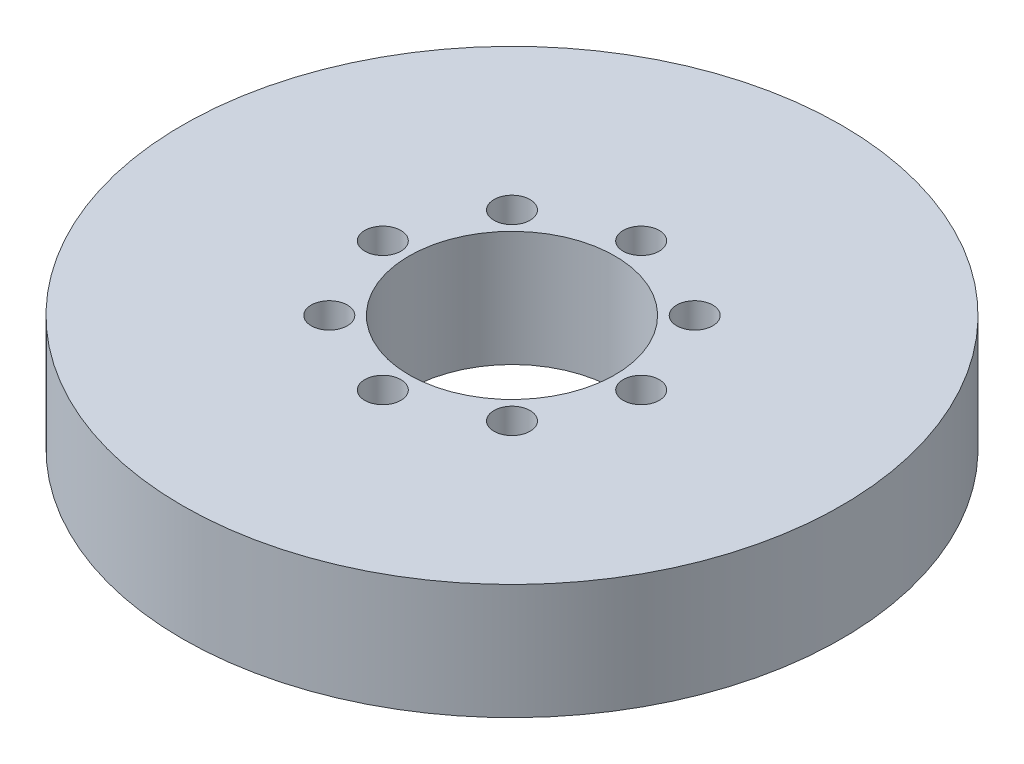
ISO-10303-21;
HEADER;
FILE_DESCRIPTION(('STEP AP214'),'2;1');
FILE_NAME('part.step','',(''),(''),'','','');
FILE_SCHEMA(('AUTOMOTIVE_DESIGN { 1 0 10303 214 1 1 1 1 }'));
ENDSEC;
DATA;
#1=APPLICATION_CONTEXT('core data for automotive mechanical design processes');
#2=APPLICATION_PROTOCOL_DEFINITION('international standard','automotive_design',2000,#1);
#3=PRODUCT_CONTEXT('',#1,'mechanical');
#4=PRODUCT('Part','Part','',(#3));
#5=PRODUCT_RELATED_PRODUCT_CATEGORY('part','',(#4));
#6=PRODUCT_DEFINITION_FORMATION('','',#4);
#7=PRODUCT_DEFINITION_CONTEXT('part definition',#1,'design');
#8=PRODUCT_DEFINITION('design','',#6,#7);
#9=PRODUCT_DEFINITION_SHAPE('','',#8);
#10=(LENGTH_UNIT() NAMED_UNIT(*) SI_UNIT(.MILLI.,.METRE.));
#11=(NAMED_UNIT(*) PLANE_ANGLE_UNIT() SI_UNIT($,.RADIAN.));
#12=(NAMED_UNIT(*) SI_UNIT($,.STERADIAN.) SOLID_ANGLE_UNIT());
#13=UNCERTAINTY_MEASURE_WITH_UNIT(LENGTH_MEASURE(1.E-05),#10,'distance_accuracy_value','');
#14=(GEOMETRIC_REPRESENTATION_CONTEXT(3) GLOBAL_UNCERTAINTY_ASSIGNED_CONTEXT((#13)) GLOBAL_UNIT_ASSIGNED_CONTEXT((#10,
#11,#12)) REPRESENTATION_CONTEXT('',''));
#15=CARTESIAN_POINT('',(0.,0.,0.));
#16=DIRECTION('',(0.,0.,1.));
#17=DIRECTION('',(1.,0.,0.));
#18=AXIS2_PLACEMENT_3D('',#15,#16,#17);
#19=CARTESIAN_POINT('',(0.,14.,0.));
#20=DIRECTION('',(0.,-1.,0.));
#21=DIRECTION('',(0.,0.,-1.));
#22=AXIS2_PLACEMENT_3D('',#19,#20,#21);
#23=CYLINDRICAL_SURFACE('',#22,40.);
#24=CARTESIAN_POINT('',(0.,14.,0.));
#25=DIRECTION('',(0.,1.,0.));
#26=DIRECTION('',(0.,0.,1.));
#27=AXIS2_PLACEMENT_3D('',#24,#25,#26);
#28=CIRCLE('',#27,40.);
#29=CARTESIAN_POINT('',(0.,14.,40.));
#30=VERTEX_POINT('',#29);
#31=EDGE_CURVE('E10',#30,#30,#28,.T.);
#32=ORIENTED_EDGE('',*,*,#31,.F.);
#33=EDGE_LOOP('',(#32));
#34=FACE_BOUND('',#33,.T.);
#35=CARTESIAN_POINT('',(0.,0.,0.));
#36=DIRECTION('',(0.,1.,0.));
#37=DIRECTION('',(0.,0.,1.));
#38=AXIS2_PLACEMENT_3D('',#35,#36,#37);
#39=CIRCLE('',#38,40.);
#40=CARTESIAN_POINT('',(0.,0.,40.));
#41=VERTEX_POINT('',#40);
#42=EDGE_CURVE('E37',#41,#41,#39,.T.);
#43=ORIENTED_EDGE('',*,*,#42,.T.);
#44=EDGE_LOOP('',(#43));
#45=FACE_BOUND('',#44,.T.);
#46=ADVANCED_FACE('F40',(#34,#45),#23,.T.);
#47=CARTESIAN_POINT('',(0.,14.,0.));
#48=DIRECTION('',(0.,1.,0.));
#49=DIRECTION('',(0.,0.,1.));
#50=AXIS2_PLACEMENT_3D('',#47,#48,#49);
#51=PLANE('',#50);
#52=CARTESIAN_POINT('',(0.,14.,15.6810859450207));
#53=DIRECTION('',(0.,1.,0.));
#54=DIRECTION('',(1.,0.,0.));
#55=AXIS2_PLACEMENT_3D('',#52,#53,#54);
#56=CIRCLE('',#55,2.19036456393858);
#57=CARTESIAN_POINT('',(2.19036456393864,14.,15.6810859450207));
#58=VERTEX_POINT('',#57);
#59=EDGE_CURVE('E88',#58,#58,#56,.T.);
#60=ORIENTED_EDGE('',*,*,#59,.F.);
#61=EDGE_LOOP('',(#60));
#62=FACE_BOUND('',#61,.T.);
#63=CARTESIAN_POINT('',(11.0882022080932,14.,11.0882022080931));
#64=DIRECTION('',(0.,1.,0.));
#65=DIRECTION('',(0.707106781186544,0.,-0.707106781186551));
#66=AXIS2_PLACEMENT_3D('',#63,#64,#65);
#67=CIRCLE('',#66,2.19036456393858);
#68=CARTESIAN_POINT('',(12.6370238445249,14.,9.53938057166142));
#69=VERTEX_POINT('',#68);
#70=EDGE_CURVE('E79',#69,#69,#67,.T.);
#71=ORIENTED_EDGE('',*,*,#70,.F.);
#72=EDGE_LOOP('',(#71));
#73=FACE_BOUND('',#72,.T.);
#74=CARTESIAN_POINT('',(15.6810859450207,14.,0.));
#75=DIRECTION('',(0.,1.,0.));
#76=DIRECTION('',(0.,0.,-1.));
#77=AXIS2_PLACEMENT_3D('',#74,#75,#76);
#78=CIRCLE('',#77,2.19036456393858);
#79=CARTESIAN_POINT('',(15.6810859450207,14.,-2.19036456393858));
#80=VERTEX_POINT('',#79);
#81=EDGE_CURVE('E74',#80,#80,#78,.T.);
#82=ORIENTED_EDGE('',*,*,#81,.F.);
#83=EDGE_LOOP('',(#82));
#84=FACE_BOUND('',#83,.T.);
#85=CARTESIAN_POINT('',(11.0882022080931,14.,-11.0882022080933));
#86=DIRECTION('',(0.,1.,0.));
#87=DIRECTION('',(-0.707106781186554,0.,-0.707106781186541));
#88=AXIS2_PLACEMENT_3D('',#85,#86,#87);
#89=CIRCLE('',#88,2.19036456393858);
#90=CARTESIAN_POINT('',(9.53938057166138,14.,-12.6370238445249));
#91=VERTEX_POINT('',#90);
#92=EDGE_CURVE('E70',#91,#91,#89,.T.);
#93=ORIENTED_EDGE('',*,*,#92,.F.);
#94=EDGE_LOOP('',(#93));
#95=FACE_BOUND('',#94,.T.);
#96=CARTESIAN_POINT('',(-1.64250656849505E-13,14.,-15.6810859450207));
#97=DIRECTION('',(0.,1.,0.));
#98=DIRECTION('',(-1.,0.,0.));
#99=AXIS2_PLACEMENT_3D('',#96,#97,#98);
#100=CIRCLE('',#99,2.19036456393858);
#101=CARTESIAN_POINT('',(-2.19036456393875,14.,-15.6810859450206));
#102=VERTEX_POINT('',#101);
#103=EDGE_CURVE('E100',#102,#102,#100,.T.);
#104=ORIENTED_EDGE('',*,*,#103,.F.);
#105=EDGE_LOOP('',(#104));
#106=FACE_BOUND('',#105,.T.);
#107=CARTESIAN_POINT('',(-11.0882022080933,14.,-11.088202208093));
#108=DIRECTION('',(0.,1.,0.));
#109=DIRECTION('',(-0.707106781186539,0.,0.707106781186556));
#110=AXIS2_PLACEMENT_3D('',#107,#108,#109);
#111=CIRCLE('',#110,2.19036456393858);
#112=CARTESIAN_POINT('',(-12.637023844525,14.,-9.53938057166133));
#113=VERTEX_POINT('',#112);
#114=EDGE_CURVE('E93',#113,#113,#111,.T.);
#115=ORIENTED_EDGE('',*,*,#114,.F.);
#116=EDGE_LOOP('',(#115));
#117=FACE_BOUND('',#116,.T.);
#118=CARTESIAN_POINT('',(-11.0882022080932,14.,11.0882022080932));
#119=DIRECTION('',(0.,1.,0.));
#120=DIRECTION('',(0.707106781186549,0.,0.707106781186546));
#121=AXIS2_PLACEMENT_3D('',#118,#119,#120);
#122=CIRCLE('',#121,2.19036456393858);
#123=CARTESIAN_POINT('',(-9.53938057166146,14.,12.6370238445249));
#124=VERTEX_POINT('',#123);
#125=EDGE_CURVE('E61',#124,#124,#122,.T.);
#126=ORIENTED_EDGE('',*,*,#125,.F.);
#127=EDGE_LOOP('',(#126));
#128=FACE_BOUND('',#127,.T.);
#129=CARTESIAN_POINT('',(-15.6810859450207,14.,0.));
#130=DIRECTION('',(0.,1.,0.));
#131=DIRECTION('',(0.,0.,1.));
#132=AXIS2_PLACEMENT_3D('',#129,#130,#131);
#133=CIRCLE('',#132,2.19036456393858);
#134=CARTESIAN_POINT('',(-15.6810859450207,14.,2.19036456393858));
#135=VERTEX_POINT('',#134);
#136=EDGE_CURVE('E54',#135,#135,#133,.T.);
#137=ORIENTED_EDGE('',*,*,#136,.F.);
#138=EDGE_LOOP('',(#137));
#139=FACE_BOUND('',#138,.T.);
#140=CARTESIAN_POINT('',(0.,14.,0.));
#141=DIRECTION('',(0.,1.,0.));
#142=DIRECTION('',(0.,0.,1.));
#143=AXIS2_PLACEMENT_3D('',#140,#141,#142);
#144=CIRCLE('',#143,12.5);
#145=CARTESIAN_POINT('',(0.,14.,12.5));
#146=VERTEX_POINT('',#145);
#147=EDGE_CURVE('E50',#146,#146,#144,.T.);
#148=ORIENTED_EDGE('',*,*,#147,.F.);
#149=EDGE_LOOP('',(#148));
#150=FACE_BOUND('',#149,.T.);
#151=ORIENTED_EDGE('',*,*,#31,.T.);
#152=EDGE_LOOP('',(#151));
#153=FACE_BOUND('',#152,.T.);
#154=ADVANCED_FACE('F115',(#62,#73,#84,#95,#106,#117,#128,#139,#150,#153),#51,.T.);
#155=CARTESIAN_POINT('',(0.,0.,0.));
#156=DIRECTION('',(0.,1.,0.));
#157=DIRECTION('',(0.,0.,1.));
#158=AXIS2_PLACEMENT_3D('',#155,#156,#157);
#159=PLANE('',#158);
#160=CARTESIAN_POINT('',(0.,0.,0.));
#161=DIRECTION('',(0.,1.,0.));
#162=DIRECTION('',(0.,0.,1.));
#163=AXIS2_PLACEMENT_3D('',#160,#161,#162);
#164=CIRCLE('',#163,12.5);
#165=CARTESIAN_POINT('',(0.,0.,12.5));
#166=VERTEX_POINT('',#165);
#167=EDGE_CURVE('E47',#166,#166,#164,.T.);
#168=ORIENTED_EDGE('',*,*,#167,.T.);
#169=EDGE_LOOP('',(#168));
#170=FACE_BOUND('',#169,.T.);
#171=ORIENTED_EDGE('',*,*,#42,.F.);
#172=EDGE_LOOP('',(#171));
#173=FACE_BOUND('',#172,.T.);
#174=ADVANCED_FACE('F113',(#170,#173),#159,.F.);
#175=CARTESIAN_POINT('',(0.,14.,0.));
#176=DIRECTION('',(0.,-1.,0.));
#177=DIRECTION('',(0.,0.,-1.));
#178=AXIS2_PLACEMENT_3D('',#175,#176,#177);
#179=CYLINDRICAL_SURFACE('',#178,12.5);
#180=ORIENTED_EDGE('',*,*,#147,.T.);
#181=EDGE_LOOP('',(#180));
#182=FACE_BOUND('',#181,.T.);
#183=ORIENTED_EDGE('',*,*,#167,.F.);
#184=EDGE_LOOP('',(#183));
#185=FACE_BOUND('',#184,.T.);
#186=ADVANCED_FACE('F127',(#182,#185),#179,.F.);
#187=CARTESIAN_POINT('',(-15.6810859450207,2.38136706259917,0.));
#188=DIRECTION('',(0.,1.,0.));
#189=DIRECTION('',(0.,0.,1.));
#190=AXIS2_PLACEMENT_3D('',#187,#188,#189);
#191=CYLINDRICAL_SURFACE('',#190,2.19036456393858);
#192=CARTESIAN_POINT('',(-15.6810859450207,2.38136706259917,0.));
#193=DIRECTION('',(0.,1.,0.));
#194=DIRECTION('',(0.,0.,1.));
#195=AXIS2_PLACEMENT_3D('',#192,#193,#194);
#196=CIRCLE('',#195,2.19036456393858);
#197=CARTESIAN_POINT('',(-15.6810859450207,2.38136706259917,2.19036456393858));
#198=VERTEX_POINT('',#197);
#199=EDGE_CURVE('E55',#198,#198,#196,.T.);
#200=ORIENTED_EDGE('',*,*,#199,.F.);
#201=EDGE_LOOP('',(#200));
#202=FACE_BOUND('',#201,.T.);
#203=ORIENTED_EDGE('',*,*,#136,.T.);
#204=EDGE_LOOP('',(#203));
#205=FACE_BOUND('',#204,.T.);
#206=ADVANCED_FACE('F129',(#202,#205),#191,.F.);
#207=CARTESIAN_POINT('',(-15.6810859450207,2.38136706259917,0.));
#208=DIRECTION('',(0.,1.,0.));
#209=DIRECTION('',(0.,0.,1.));
#210=AXIS2_PLACEMENT_3D('',#207,#208,#209);
#211=PLANE('',#210);
#212=ORIENTED_EDGE('',*,*,#199,.T.);
#213=EDGE_LOOP('',(#212));
#214=FACE_BOUND('',#213,.T.);
#215=ADVANCED_FACE('F157',(#214),#211,.T.);
#216=CARTESIAN_POINT('',(-11.0882022080932,2.38136706259917,11.0882022080932));
#217=DIRECTION('',(0.,1.,0.));
#218=DIRECTION('',(0.,0.,1.));
#219=AXIS2_PLACEMENT_3D('',#216,#217,#218);
#220=CYLINDRICAL_SURFACE('',#219,2.19036456393858);
#221=CARTESIAN_POINT('',(-11.0882022080932,2.38136706259917,11.0882022080932));
#222=DIRECTION('',(0.,1.,0.));
#223=DIRECTION('',(0.707106781186549,0.,0.707106781186546));
#224=AXIS2_PLACEMENT_3D('',#221,#222,#223);
#225=CIRCLE('',#224,2.19036456393858);
#226=CARTESIAN_POINT('',(-9.53938057166146,2.38136706259917,12.6370238445249));
#227=VERTEX_POINT('',#226);
#228=EDGE_CURVE('E59',#227,#227,#225,.T.);
#229=ORIENTED_EDGE('',*,*,#228,.F.);
#230=EDGE_LOOP('',(#229));
#231=FACE_BOUND('',#230,.T.);
#232=ORIENTED_EDGE('',*,*,#125,.T.);
#233=EDGE_LOOP('',(#232));
#234=FACE_BOUND('',#233,.T.);
#235=ADVANCED_FACE('F170',(#231,#234),#220,.F.);
#236=CARTESIAN_POINT('',(-11.0882022080932,2.38136706259917,11.0882022080932));
#237=DIRECTION('',(0.,1.,0.));
#238=DIRECTION('',(0.707106781186549,0.,0.707106781186546));
#239=AXIS2_PLACEMENT_3D('',#236,#237,#238);
#240=PLANE('',#239);
#241=ORIENTED_EDGE('',*,*,#228,.T.);
#242=EDGE_LOOP('',(#241));
#243=FACE_BOUND('',#242,.T.);
#244=ADVANCED_FACE('F182',(#243),#240,.T.);
#245=CARTESIAN_POINT('',(-11.0882022080933,2.38136706259917,-11.088202208093));
#246=DIRECTION('',(0.,1.,0.));
#247=DIRECTION('',(0.,0.,1.));
#248=AXIS2_PLACEMENT_3D('',#245,#246,#247);
#249=CYLINDRICAL_SURFACE('',#248,2.19036456393858);
#250=CARTESIAN_POINT('',(-11.0882022080933,2.38136706259917,-11.088202208093));
#251=DIRECTION('',(0.,1.,0.));
#252=DIRECTION('',(-0.707106781186539,0.,0.707106781186556));
#253=AXIS2_PLACEMENT_3D('',#250,#251,#252);
#254=CIRCLE('',#253,2.19036456393858);
#255=CARTESIAN_POINT('',(-12.637023844525,2.38136706259917,-9.53938057166133));
#256=VERTEX_POINT('',#255);
#257=EDGE_CURVE('E94',#256,#256,#254,.T.);
#258=ORIENTED_EDGE('',*,*,#257,.F.);
#259=EDGE_LOOP('',(#258));
#260=FACE_BOUND('',#259,.T.);
#261=ORIENTED_EDGE('',*,*,#114,.T.);
#262=EDGE_LOOP('',(#261));
#263=FACE_BOUND('',#262,.T.);
#264=ADVANCED_FACE('F189',(#260,#263),#249,.F.);
#265=CARTESIAN_POINT('',(-11.0882022080933,2.38136706259917,-11.088202208093));
#266=DIRECTION('',(0.,1.,0.));
#267=DIRECTION('',(-0.707106781186539,0.,0.707106781186556));
#268=AXIS2_PLACEMENT_3D('',#265,#266,#267);
#269=PLANE('',#268);
#270=ORIENTED_EDGE('',*,*,#257,.T.);
#271=EDGE_LOOP('',(#270));
#272=FACE_BOUND('',#271,.T.);
#273=ADVANCED_FACE('F107',(#272),#269,.T.);
#274=CARTESIAN_POINT('',(-1.64250656849505E-13,2.38136706259917,-15.6810859450207));
#275=DIRECTION('',(0.,1.,0.));
#276=DIRECTION('',(0.,0.,1.));
#277=AXIS2_PLACEMENT_3D('',#274,#275,#276);
#278=CYLINDRICAL_SURFACE('',#277,2.19036456393858);
#279=CARTESIAN_POINT('',(-1.64250656849505E-13,2.38136706259917,-15.6810859450207));
#280=DIRECTION('',(0.,1.,0.));
#281=DIRECTION('',(-1.,0.,0.));
#282=AXIS2_PLACEMENT_3D('',#279,#280,#281);
#283=CIRCLE('',#282,2.19036456393858);
#284=CARTESIAN_POINT('',(-2.19036456393875,2.38136706259917,-15.6810859450206));
#285=VERTEX_POINT('',#284);
#286=EDGE_CURVE('E72',#285,#285,#283,.T.);
#287=ORIENTED_EDGE('',*,*,#286,.F.);
#288=EDGE_LOOP('',(#287));
#289=FACE_BOUND('',#288,.T.);
#290=ORIENTED_EDGE('',*,*,#103,.T.);
#291=EDGE_LOOP('',(#290));
#292=FACE_BOUND('',#291,.T.);
#293=ADVANCED_FACE('F104',(#289,#292),#278,.F.);
#294=CARTESIAN_POINT('',(-1.64250656849505E-13,2.38136706259917,-15.6810859450207));
#295=DIRECTION('',(0.,1.,0.));
#296=DIRECTION('',(-1.,0.,0.));
#297=AXIS2_PLACEMENT_3D('',#294,#295,#296);
#298=PLANE('',#297);
#299=ORIENTED_EDGE('',*,*,#286,.T.);
#300=EDGE_LOOP('',(#299));
#301=FACE_BOUND('',#300,.T.);
#302=ADVANCED_FACE('F103',(#301),#298,.T.);
#303=CARTESIAN_POINT('',(11.0882022080931,2.38136706259917,-11.0882022080933));
#304=DIRECTION('',(0.,1.,0.));
#305=DIRECTION('',(0.,0.,1.));
#306=AXIS2_PLACEMENT_3D('',#303,#304,#305);
#307=CYLINDRICAL_SURFACE('',#306,2.19036456393858);
#308=CARTESIAN_POINT('',(11.0882022080931,2.38136706259917,-11.0882022080933));
#309=DIRECTION('',(0.,1.,0.));
#310=DIRECTION('',(-0.707106781186554,0.,-0.707106781186541));
#311=AXIS2_PLACEMENT_3D('',#308,#309,#310);
#312=CIRCLE('',#311,2.19036456393858);
#313=CARTESIAN_POINT('',(9.53938057166138,2.38136706259917,-12.6370238445249));
#314=VERTEX_POINT('',#313);
#315=EDGE_CURVE('E69',#314,#314,#312,.T.);
#316=ORIENTED_EDGE('',*,*,#315,.F.);
#317=EDGE_LOOP('',(#316));
#318=FACE_BOUND('',#317,.T.);
#319=ORIENTED_EDGE('',*,*,#92,.T.);
#320=EDGE_LOOP('',(#319));
#321=FACE_BOUND('',#320,.T.);
#322=ADVANCED_FACE('F219',(#318,#321),#307,.F.);
#323=CARTESIAN_POINT('',(11.0882022080931,2.38136706259917,-11.0882022080933));
#324=DIRECTION('',(0.,1.,0.));
#325=DIRECTION('',(-0.707106781186554,0.,-0.707106781186541));
#326=AXIS2_PLACEMENT_3D('',#323,#324,#325);
#327=PLANE('',#326);
#328=ORIENTED_EDGE('',*,*,#315,.T.);
#329=EDGE_LOOP('',(#328));
#330=FACE_BOUND('',#329,.T.);
#331=ADVANCED_FACE('F227',(#330),#327,.T.);
#332=CARTESIAN_POINT('',(15.6810859450207,2.38136706259917,0.));
#333=DIRECTION('',(0.,1.,0.));
#334=DIRECTION('',(0.,0.,1.));
#335=AXIS2_PLACEMENT_3D('',#332,#333,#334);
#336=CYLINDRICAL_SURFACE('',#335,2.19036456393858);
#337=CARTESIAN_POINT('',(15.6810859450207,2.38136706259917,0.));
#338=DIRECTION('',(0.,1.,0.));
#339=DIRECTION('',(0.,0.,-1.));
#340=AXIS2_PLACEMENT_3D('',#337,#338,#339);
#341=CIRCLE('',#340,2.19036456393858);
#342=CARTESIAN_POINT('',(15.6810859450207,2.38136706259917,-2.19036456393858));
#343=VERTEX_POINT('',#342);
#344=EDGE_CURVE('E80',#343,#343,#341,.T.);
#345=ORIENTED_EDGE('',*,*,#344,.F.);
#346=EDGE_LOOP('',(#345));
#347=FACE_BOUND('',#346,.T.);
#348=ORIENTED_EDGE('',*,*,#81,.T.);
#349=EDGE_LOOP('',(#348));
#350=FACE_BOUND('',#349,.T.);
#351=ADVANCED_FACE('F240',(#347,#350),#336,.F.);
#352=CARTESIAN_POINT('',(15.6810859450207,2.38136706259917,0.));
#353=DIRECTION('',(0.,1.,0.));
#354=DIRECTION('',(0.,0.,-1.));
#355=AXIS2_PLACEMENT_3D('',#352,#353,#354);
#356=PLANE('',#355);
#357=ORIENTED_EDGE('',*,*,#344,.T.);
#358=EDGE_LOOP('',(#357));
#359=FACE_BOUND('',#358,.T.);
#360=ADVANCED_FACE('F246',(#359),#356,.T.);
#361=CARTESIAN_POINT('',(11.0882022080932,2.38136706259917,11.0882022080931));
#362=DIRECTION('',(0.,1.,0.));
#363=DIRECTION('',(0.,0.,1.));
#364=AXIS2_PLACEMENT_3D('',#361,#362,#363);
#365=CYLINDRICAL_SURFACE('',#364,2.19036456393858);
#366=CARTESIAN_POINT('',(11.0882022080932,2.38136706259917,11.0882022080931));
#367=DIRECTION('',(0.,1.,0.));
#368=DIRECTION('',(0.707106781186544,0.,-0.707106781186551));
#369=AXIS2_PLACEMENT_3D('',#366,#367,#368);
#370=CIRCLE('',#369,2.19036456393858);
#371=CARTESIAN_POINT('',(12.6370238445249,2.38136706259917,9.53938057166142));
#372=VERTEX_POINT('',#371);
#373=EDGE_CURVE('E82',#372,#372,#370,.T.);
#374=ORIENTED_EDGE('',*,*,#373,.F.);
#375=EDGE_LOOP('',(#374));
#376=FACE_BOUND('',#375,.T.);
#377=ORIENTED_EDGE('',*,*,#70,.T.);
#378=EDGE_LOOP('',(#377));
#379=FACE_BOUND('',#378,.T.);
#380=ADVANCED_FACE('F254',(#376,#379),#365,.F.);
#381=CARTESIAN_POINT('',(11.0882022080932,2.38136706259917,11.0882022080931));
#382=DIRECTION('',(0.,1.,0.));
#383=DIRECTION('',(0.707106781186544,0.,-0.707106781186551));
#384=AXIS2_PLACEMENT_3D('',#381,#382,#383);
#385=PLANE('',#384);
#386=ORIENTED_EDGE('',*,*,#373,.T.);
#387=EDGE_LOOP('',(#386));
#388=FACE_BOUND('',#387,.T.);
#389=ADVANCED_FACE('F262',(#388),#385,.T.);
#390=CARTESIAN_POINT('',(0.,2.38136706259917,15.6810859450207));
#391=DIRECTION('',(0.,1.,0.));
#392=DIRECTION('',(0.,0.,1.));
#393=AXIS2_PLACEMENT_3D('',#390,#391,#392);
#394=CYLINDRICAL_SURFACE('',#393,2.19036456393858);
#395=CARTESIAN_POINT('',(0.,2.38136706259917,15.6810859450207));
#396=DIRECTION('',(0.,1.,0.));
#397=DIRECTION('',(1.,0.,0.));
#398=AXIS2_PLACEMENT_3D('',#395,#396,#397);
#399=CIRCLE('',#398,2.19036456393858);
#400=CARTESIAN_POINT('',(2.19036456393864,2.38136706259917,15.6810859450207));
#401=VERTEX_POINT('',#400);
#402=EDGE_CURVE('E63',#401,#401,#399,.T.);
#403=ORIENTED_EDGE('',*,*,#402,.F.);
#404=EDGE_LOOP('',(#403));
#405=FACE_BOUND('',#404,.T.);
#406=ORIENTED_EDGE('',*,*,#59,.T.);
#407=EDGE_LOOP('',(#406));
#408=FACE_BOUND('',#407,.T.);
#409=ADVANCED_FACE('F272',(#405,#408),#394,.F.);
#410=CARTESIAN_POINT('',(0.,2.38136706259917,15.6810859450207));
#411=DIRECTION('',(0.,1.,0.));
#412=DIRECTION('',(1.,0.,0.));
#413=AXIS2_PLACEMENT_3D('',#410,#411,#412);
#414=PLANE('',#413);
#415=ORIENTED_EDGE('',*,*,#402,.T.);
#416=EDGE_LOOP('',(#415));
#417=FACE_BOUND('',#416,.T.);
#418=ADVANCED_FACE('F285',(#417),#414,.T.);
#419=CLOSED_SHELL('',(#46,#154,#174,#186,#206,#215,#235,#244,#264,#273,#293,#302,#322,#331,#351,
#360,#380,#389,#409,#418));
#420=MANIFOLD_SOLID_BREP('B2',#419);
#421=ADVANCED_BREP_SHAPE_REPRESENTATION('',(#18,#420),#14);
#422=SHAPE_DEFINITION_REPRESENTATION(#9,#421);
ENDSEC;
END-ISO-10303-21;
